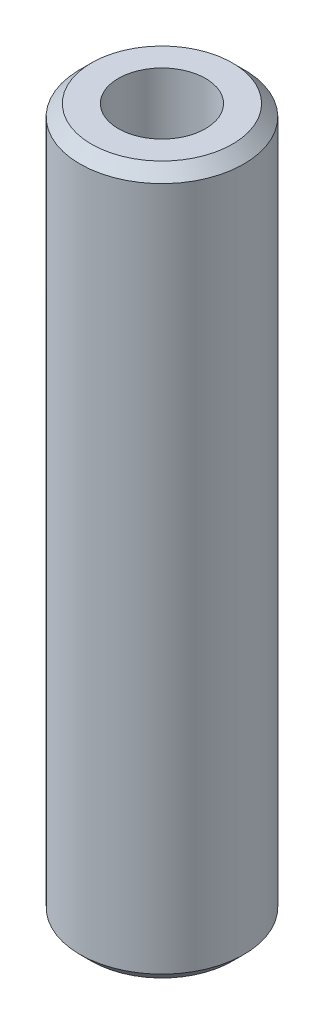
ISO-10303-21;
HEADER;
FILE_DESCRIPTION(('STEP AP214'),'2;1');
FILE_NAME('part.step','',(''),(''),'','','');
FILE_SCHEMA(('AUTOMOTIVE_DESIGN { 1 0 10303 214 1 1 1 1 }'));
ENDSEC;
DATA;
#1=APPLICATION_CONTEXT('core data for automotive mechanical design processes');
#2=APPLICATION_PROTOCOL_DEFINITION('international standard','automotive_design',2000,#1);
#3=PRODUCT_CONTEXT('',#1,'mechanical');
#4=PRODUCT('Part','Part','',(#3));
#5=PRODUCT_RELATED_PRODUCT_CATEGORY('part','',(#4));
#6=PRODUCT_DEFINITION_FORMATION('','',#4);
#7=PRODUCT_DEFINITION_CONTEXT('part definition',#1,'design');
#8=PRODUCT_DEFINITION('design','',#6,#7);
#9=PRODUCT_DEFINITION_SHAPE('','',#8);
#10=(LENGTH_UNIT() NAMED_UNIT(*) SI_UNIT(.MILLI.,.METRE.));
#11=(NAMED_UNIT(*) PLANE_ANGLE_UNIT() SI_UNIT($,.RADIAN.));
#12=(NAMED_UNIT(*) SI_UNIT($,.STERADIAN.) SOLID_ANGLE_UNIT());
#13=UNCERTAINTY_MEASURE_WITH_UNIT(LENGTH_MEASURE(1.E-05),#10,'distance_accuracy_value','');
#14=(GEOMETRIC_REPRESENTATION_CONTEXT(3) GLOBAL_UNCERTAINTY_ASSIGNED_CONTEXT((#13)) GLOBAL_UNIT_ASSIGNED_CONTEXT((#10,
#11,#12)) REPRESENTATION_CONTEXT('',''));
#15=CARTESIAN_POINT('',(0.,0.,0.));
#16=DIRECTION('',(0.,0.,1.));
#17=DIRECTION('',(1.,0.,0.));
#18=AXIS2_PLACEMENT_3D('',#15,#16,#17);
#19=CARTESIAN_POINT('',(0.,129.547626299492,0.));
#20=DIRECTION('',(0.,-1.,0.));
#21=DIRECTION('',(0.,0.,-1.));
#22=AXIS2_PLACEMENT_3D('',#19,#20,#21);
#23=CYLINDRICAL_SURFACE('',#22,15.);
#24=CARTESIAN_POINT('',(0.,127.4499474127,0.));
#25=DIRECTION('',(0.,1.,0.));
#26=DIRECTION('',(0.,0.,1.));
#27=AXIS2_PLACEMENT_3D('',#24,#25,#26);
#28=CIRCLE('',#27,15.);
#29=CARTESIAN_POINT('',(0.,127.4499474127,15.));
#30=VERTEX_POINT('',#29);
#31=EDGE_CURVE('E50',#30,#30,#28,.F.);
#32=ORIENTED_EDGE('',*,*,#31,.T.);
#33=EDGE_LOOP('',(#32));
#34=FACE_BOUND('',#33,.T.);
#35=CARTESIAN_POINT('',(0.,2.09767888679122,0.));
#36=DIRECTION('',(0.,1.,0.));
#37=DIRECTION('',(0.,0.,1.));
#38=AXIS2_PLACEMENT_3D('',#35,#36,#37);
#39=CIRCLE('',#38,15.);
#40=CARTESIAN_POINT('',(0.,2.09767888679122,15.));
#41=VERTEX_POINT('',#40);
#42=EDGE_CURVE('E51',#41,#41,#39,.T.);
#43=ORIENTED_EDGE('',*,*,#42,.T.);
#44=EDGE_LOOP('',(#43));
#45=FACE_BOUND('',#44,.T.);
#46=ADVANCED_FACE('F39',(#34,#45),#23,.T.);
#47=CARTESIAN_POINT('',(0.,129.547626299492,0.));
#48=DIRECTION('',(0.,1.,0.));
#49=DIRECTION('',(0.,0.,1.));
#50=AXIS2_PLACEMENT_3D('',#47,#48,#49);
#51=PLANE('',#50);
#52=CARTESIAN_POINT('',(0.,129.547626299492,0.));
#53=DIRECTION('',(0.,1.,0.));
#54=DIRECTION('',(0.,0.,1.));
#55=AXIS2_PLACEMENT_3D('',#52,#53,#54);
#56=CIRCLE('',#55,12.9023211132087);
#57=CARTESIAN_POINT('',(0.,129.547626299492,12.9023211132087));
#58=VERTEX_POINT('',#57);
#59=EDGE_CURVE('E54',#58,#58,#56,.T.);
#60=ORIENTED_EDGE('',*,*,#59,.T.);
#61=EDGE_LOOP('',(#60));
#62=FACE_BOUND('',#61,.T.);
#63=CARTESIAN_POINT('',(0.,129.547626299492,0.));
#64=DIRECTION('',(0.,1.,0.));
#65=DIRECTION('',(0.,0.,1.));
#66=AXIS2_PLACEMENT_3D('',#63,#64,#65);
#67=CIRCLE('',#66,7.98085212066798);
#68=CARTESIAN_POINT('',(0.,129.547626299492,7.98085212066798));
#69=VERTEX_POINT('',#68);
#70=EDGE_CURVE('E58',#69,#69,#67,.T.);
#71=ORIENTED_EDGE('',*,*,#70,.F.);
#72=EDGE_LOOP('',(#71));
#73=FACE_BOUND('',#72,.T.);
#74=ADVANCED_FACE('F69',(#62,#73),#51,.T.);
#75=CARTESIAN_POINT('',(0.,0.,0.));
#76=DIRECTION('',(0.,1.,0.));
#77=DIRECTION('',(0.,0.,1.));
#78=AXIS2_PLACEMENT_3D('',#75,#76,#77);
#79=PLANE('',#78);
#80=CARTESIAN_POINT('',(0.,0.,0.));
#81=DIRECTION('',(0.,1.,0.));
#82=DIRECTION('',(0.,0.,1.));
#83=AXIS2_PLACEMENT_3D('',#80,#81,#82);
#84=CIRCLE('',#83,12.9023211132088);
#85=CARTESIAN_POINT('',(0.,0.,12.9023211132088));
#86=VERTEX_POINT('',#85);
#87=EDGE_CURVE('E10',#86,#86,#84,.F.);
#88=ORIENTED_EDGE('',*,*,#87,.T.);
#89=EDGE_LOOP('',(#88));
#90=FACE_BOUND('',#89,.T.);
#91=CARTESIAN_POINT('',(0.,0.,0.));
#92=DIRECTION('',(0.,1.,0.));
#93=DIRECTION('',(0.,0.,1.));
#94=AXIS2_PLACEMENT_3D('',#91,#92,#93);
#95=CIRCLE('',#94,7.98085212066798);
#96=CARTESIAN_POINT('',(0.,0.,7.98085212066798));
#97=VERTEX_POINT('',#96);
#98=EDGE_CURVE('E63',#97,#97,#95,.T.);
#99=ORIENTED_EDGE('',*,*,#98,.T.);
#100=EDGE_LOOP('',(#99));
#101=FACE_BOUND('',#100,.T.);
#102=ADVANCED_FACE('F75',(#90,#101),#79,.F.);
#103=CARTESIAN_POINT('',(0.,129.547626299492,0.));
#104=DIRECTION('',(0.,-1.,0.));
#105=DIRECTION('',(0.,0.,-1.));
#106=AXIS2_PLACEMENT_3D('',#103,#104,#105);
#107=CYLINDRICAL_SURFACE('',#106,7.98085212066798);
#108=ORIENTED_EDGE('',*,*,#70,.T.);
#109=EDGE_LOOP('',(#108));
#110=FACE_BOUND('',#109,.T.);
#111=ORIENTED_EDGE('',*,*,#98,.F.);
#112=EDGE_LOOP('',(#111));
#113=FACE_BOUND('',#112,.T.);
#114=ADVANCED_FACE('F70',(#110,#113),#107,.F.);
#115=CARTESIAN_POINT('',(0.,129.547626299492,0.));
#116=DIRECTION('',(0.,-1.,0.));
#117=DIRECTION('',(0.,0.,-1.));
#118=AXIS2_PLACEMENT_3D('',#115,#116,#117);
#119=CONICAL_SURFACE('',#118,12.9023211132087,0.785398163397445);
#120=ORIENTED_EDGE('',*,*,#31,.F.);
#121=EDGE_LOOP('',(#120));
#122=FACE_BOUND('',#121,.T.);
#123=ORIENTED_EDGE('',*,*,#59,.F.);
#124=EDGE_LOOP('',(#123));
#125=FACE_BOUND('',#124,.T.);
#126=ADVANCED_FACE('F81',(#122,#125),#119,.T.);
#127=CARTESIAN_POINT('',(0.,2.09767888679122,0.));
#128=DIRECTION('',(0.,1.,0.));
#129=DIRECTION('',(0.,0.,1.));
#130=AXIS2_PLACEMENT_3D('',#127,#128,#129);
#131=CONICAL_SURFACE('',#130,15.,0.785398163397452);
#132=ORIENTED_EDGE('',*,*,#87,.F.);
#133=EDGE_LOOP('',(#132));
#134=FACE_BOUND('',#133,.T.);
#135=ORIENTED_EDGE('',*,*,#42,.F.);
#136=EDGE_LOOP('',(#135));
#137=FACE_BOUND('',#136,.T.);
#138=ADVANCED_FACE('F45',(#134,#137),#131,.T.);
#139=CLOSED_SHELL('',(#46,#74,#102,#114,#126,#138));
#140=MANIFOLD_SOLID_BREP('B2',#139);
#141=ADVANCED_BREP_SHAPE_REPRESENTATION('',(#18,#140),#14);
#142=SHAPE_DEFINITION_REPRESENTATION(#9,#141);
ENDSEC;
END-ISO-10303-21;
